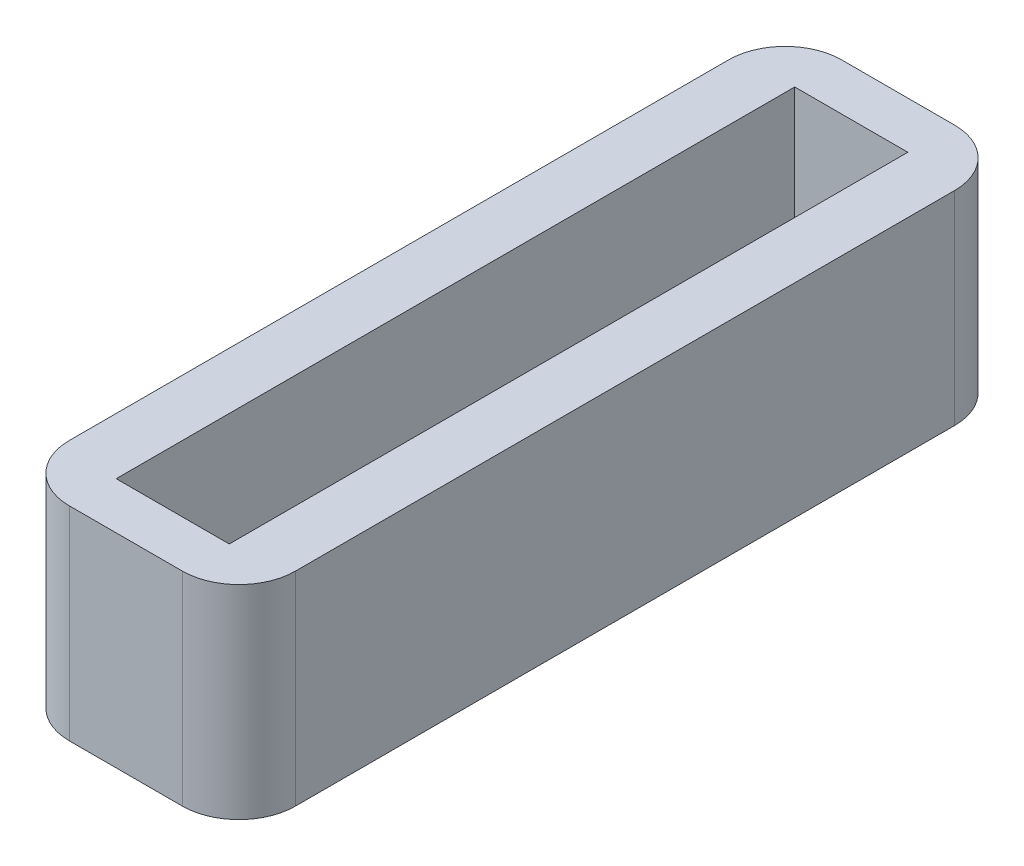
ISO-10303-21;
HEADER;
FILE_DESCRIPTION(('STEP AP214'),'2;1');
FILE_NAME('part.step','',(''),(''),'','','');
FILE_SCHEMA(('AUTOMOTIVE_DESIGN { 1 0 10303 214 1 1 1 1 }'));
ENDSEC;
DATA;
#1=APPLICATION_CONTEXT('core data for automotive mechanical design processes');
#2=APPLICATION_PROTOCOL_DEFINITION('international standard','automotive_design',2000,#1);
#3=PRODUCT_CONTEXT('',#1,'mechanical');
#4=PRODUCT('Part','Part','',(#3));
#5=PRODUCT_RELATED_PRODUCT_CATEGORY('part','',(#4));
#6=PRODUCT_DEFINITION_FORMATION('','',#4);
#7=PRODUCT_DEFINITION_CONTEXT('part definition',#1,'design');
#8=PRODUCT_DEFINITION('design','',#6,#7);
#9=PRODUCT_DEFINITION_SHAPE('','',#8);
#10=(LENGTH_UNIT() NAMED_UNIT(*) SI_UNIT(.MILLI.,.METRE.));
#11=(NAMED_UNIT(*) PLANE_ANGLE_UNIT() SI_UNIT($,.RADIAN.));
#12=(NAMED_UNIT(*) SI_UNIT($,.STERADIAN.) SOLID_ANGLE_UNIT());
#13=UNCERTAINTY_MEASURE_WITH_UNIT(LENGTH_MEASURE(1.E-05),#10,'distance_accuracy_value','');
#14=(GEOMETRIC_REPRESENTATION_CONTEXT(3) GLOBAL_UNCERTAINTY_ASSIGNED_CONTEXT((#13)) GLOBAL_UNIT_ASSIGNED_CONTEXT((#10,
#11,#12)) REPRESENTATION_CONTEXT('',''));
#15=CARTESIAN_POINT('',(0.,0.,0.));
#16=DIRECTION('',(0.,0.,1.));
#17=DIRECTION('',(1.,0.,0.));
#18=AXIS2_PLACEMENT_3D('',#15,#16,#17);
#19=CARTESIAN_POINT('',(0.,3.6,0.));
#20=DIRECTION('',(0.,1.,0.));
#21=DIRECTION('',(0.,0.,1.));
#22=AXIS2_PLACEMENT_3D('',#19,#20,#21);
#23=PLANE('',#22);
#24=DIRECTION('',(-1.,0.,0.));
#25=VECTOR('',#24,1.);
#26=CARTESIAN_POINT('',(-2.,3.6,-6.82971919942776));
#27=LINE('',#26,#25);
#28=CARTESIAN_POINT('',(0.999999999999999,3.6,-6.82971919942776));
#29=VERTEX_POINT('',#28);
#30=CARTESIAN_POINT('',(-1.,3.6,-6.82971919942776));
#31=VERTEX_POINT('',#30);
#32=EDGE_CURVE('E170',#29,#31,#27,.T.);
#33=ORIENTED_EDGE('',*,*,#32,.T.);
#34=CARTESIAN_POINT('',(-1.,3.6,-5.82971919942776));
#35=DIRECTION('',(0.,1.,0.));
#36=DIRECTION('',(0.,0.,1.));
#37=AXIS2_PLACEMENT_3D('',#34,#35,#36);
#38=CIRCLE('',#37,1.);
#39=CARTESIAN_POINT('',(-2.,3.6,-5.82971919942776));
#40=VERTEX_POINT('',#39);
#41=EDGE_CURVE('E210',#31,#40,#38,.T.);
#42=ORIENTED_EDGE('',*,*,#41,.T.);
#43=DIRECTION('',(0.,0.,1.));
#44=VECTOR('',#43,1.);
#45=CARTESIAN_POINT('',(-2.,3.6,-6.82971919942776));
#46=LINE('',#45,#44);
#47=CARTESIAN_POINT('',(-2.,3.6,5.82971919942775));
#48=VERTEX_POINT('',#47);
#49=EDGE_CURVE('E174',#40,#48,#46,.T.);
#50=ORIENTED_EDGE('',*,*,#49,.T.);
#51=CARTESIAN_POINT('',(-0.999999999999999,3.6,5.82971919942776));
#52=DIRECTION('',(0.,1.,0.));
#53=DIRECTION('',(0.,0.,1.));
#54=AXIS2_PLACEMENT_3D('',#51,#52,#53);
#55=CIRCLE('',#54,1.);
#56=CARTESIAN_POINT('',(-0.999999999999999,3.6,6.82971919942776));
#57=VERTEX_POINT('',#56);
#58=EDGE_CURVE('E56',#48,#57,#55,.T.);
#59=ORIENTED_EDGE('',*,*,#58,.T.);
#60=DIRECTION('',(1.,0.,0.));
#61=VECTOR('',#60,1.);
#62=CARTESIAN_POINT('',(-2.,3.6,6.82971919942776));
#63=LINE('',#62,#61);
#64=CARTESIAN_POINT('',(1.,3.6,6.82971919942776));
#65=VERTEX_POINT('',#64);
#66=EDGE_CURVE('E176',#57,#65,#63,.T.);
#67=ORIENTED_EDGE('',*,*,#66,.T.);
#68=CARTESIAN_POINT('',(1.,3.6,5.82971919942775));
#69=DIRECTION('',(0.,1.,0.));
#70=DIRECTION('',(0.,0.,1.));
#71=AXIS2_PLACEMENT_3D('',#68,#69,#70);
#72=CIRCLE('',#71,1.);
#73=CARTESIAN_POINT('',(2.,3.6,5.82971919942775));
#74=VERTEX_POINT('',#73);
#75=EDGE_CURVE('E205',#65,#74,#72,.T.);
#76=ORIENTED_EDGE('',*,*,#75,.T.);
#77=DIRECTION('',(0.,0.,-1.));
#78=VECTOR('',#77,1.);
#79=CARTESIAN_POINT('',(2.,3.6,-6.82971919942776));
#80=LINE('',#79,#78);
#81=CARTESIAN_POINT('',(2.,3.6,-5.82971919942776));
#82=VERTEX_POINT('',#81);
#83=EDGE_CURVE('E167',#74,#82,#80,.T.);
#84=ORIENTED_EDGE('',*,*,#83,.T.);
#85=CARTESIAN_POINT('',(0.999999999999999,3.6,-5.82971919942776));
#86=DIRECTION('',(0.,1.,0.));
#87=DIRECTION('',(0.,0.,1.));
#88=AXIS2_PLACEMENT_3D('',#85,#86,#87);
#89=CIRCLE('',#88,1.);
#90=EDGE_CURVE('E208',#82,#29,#89,.T.);
#91=ORIENTED_EDGE('',*,*,#90,.T.);
#92=EDGE_LOOP('',(#33,#42,#50,#59,#67,#76,#84,#91));
#93=FACE_BOUND('',#92,.T.);
#94=DIRECTION('',(-1.,0.,0.));
#95=VECTOR('',#94,1.);
#96=CARTESIAN_POINT('',(-1.,3.6,-6.00000000000001));
#97=LINE('',#96,#95);
#98=CARTESIAN_POINT('',(0.999999999999999,3.6,-6.00000000000001));
#99=VERTEX_POINT('',#98);
#100=CARTESIAN_POINT('',(-1.,3.6,-6.00000000000001));
#101=VERTEX_POINT('',#100);
#102=EDGE_CURVE('E136',#99,#101,#97,.T.);
#103=ORIENTED_EDGE('',*,*,#102,.F.);
#104=DIRECTION('',(0.,0.,-1.));
#105=VECTOR('',#104,1.);
#106=CARTESIAN_POINT('',(0.999999999999999,3.6,-6.00000000000001));
#107=LINE('',#106,#105);
#108=CARTESIAN_POINT('',(1.,3.6,6.));
#109=VERTEX_POINT('',#108);
#110=EDGE_CURVE('E126',#109,#99,#107,.T.);
#111=ORIENTED_EDGE('',*,*,#110,.F.);
#112=DIRECTION('',(1.,0.,0.));
#113=VECTOR('',#112,1.);
#114=CARTESIAN_POINT('',(-0.999999999999999,3.6,6.));
#115=LINE('',#114,#113);
#116=CARTESIAN_POINT('',(-0.999999999999999,3.6,6.));
#117=VERTEX_POINT('',#116);
#118=EDGE_CURVE('E151',#117,#109,#115,.T.);
#119=ORIENTED_EDGE('',*,*,#118,.F.);
#120=DIRECTION('',(0.,0.,1.));
#121=VECTOR('',#120,1.);
#122=CARTESIAN_POINT('',(-1.,3.6,-6.00000000000001));
#123=LINE('',#122,#121);
#124=EDGE_CURVE('E149',#101,#117,#123,.T.);
#125=ORIENTED_EDGE('',*,*,#124,.F.);
#126=EDGE_LOOP('',(#103,#111,#119,#125));
#127=FACE_BOUND('',#126,.T.);
#128=ADVANCED_FACE('F35',(#93,#127),#23,.T.);
#129=CARTESIAN_POINT('',(0.,0.,0.));
#130=DIRECTION('',(0.,1.,0.));
#131=DIRECTION('',(0.,0.,1.));
#132=AXIS2_PLACEMENT_3D('',#129,#130,#131);
#133=PLANE('',#132);
#134=DIRECTION('',(0.,0.,1.));
#135=VECTOR('',#134,1.);
#136=CARTESIAN_POINT('',(-2.,0.,-6.82971919942776));
#137=LINE('',#136,#135);
#138=CARTESIAN_POINT('',(-2.,0.,-5.82971919942776));
#139=VERTEX_POINT('',#138);
#140=CARTESIAN_POINT('',(-2.,0.,5.82971919942775));
#141=VERTEX_POINT('',#140);
#142=EDGE_CURVE('E184',#139,#141,#137,.T.);
#143=ORIENTED_EDGE('',*,*,#142,.F.);
#144=CARTESIAN_POINT('',(-1.,0.,-5.82971919942776));
#145=DIRECTION('',(0.,1.,0.));
#146=DIRECTION('',(0.,0.,1.));
#147=AXIS2_PLACEMENT_3D('',#144,#145,#146);
#148=CIRCLE('',#147,1.);
#149=CARTESIAN_POINT('',(-1.,0.,-6.82971919942776));
#150=VERTEX_POINT('',#149);
#151=EDGE_CURVE('E198',#139,#150,#148,.F.);
#152=ORIENTED_EDGE('',*,*,#151,.T.);
#153=DIRECTION('',(-1.,0.,0.));
#154=VECTOR('',#153,1.);
#155=CARTESIAN_POINT('',(-2.,0.,-6.82971919942776));
#156=LINE('',#155,#154);
#157=CARTESIAN_POINT('',(0.999999999999999,0.,-6.82971919942776));
#158=VERTEX_POINT('',#157);
#159=EDGE_CURVE('E181',#158,#150,#156,.T.);
#160=ORIENTED_EDGE('',*,*,#159,.F.);
#161=CARTESIAN_POINT('',(0.999999999999999,0.,-5.82971919942776));
#162=DIRECTION('',(0.,1.,0.));
#163=DIRECTION('',(0.,0.,1.));
#164=AXIS2_PLACEMENT_3D('',#161,#162,#163);
#165=CIRCLE('',#164,1.);
#166=CARTESIAN_POINT('',(2.,0.,-5.82971919942776));
#167=VERTEX_POINT('',#166);
#168=EDGE_CURVE('E196',#158,#167,#165,.F.);
#169=ORIENTED_EDGE('',*,*,#168,.T.);
#170=DIRECTION('',(0.,0.,-1.));
#171=VECTOR('',#170,1.);
#172=CARTESIAN_POINT('',(2.,0.,-6.82971919942776));
#173=LINE('',#172,#171);
#174=CARTESIAN_POINT('',(2.,0.,5.82971919942775));
#175=VERTEX_POINT('',#174);
#176=EDGE_CURVE('E144',#175,#167,#173,.T.);
#177=ORIENTED_EDGE('',*,*,#176,.F.);
#178=CARTESIAN_POINT('',(1.,0.,5.82971919942775));
#179=DIRECTION('',(0.,1.,0.));
#180=DIRECTION('',(0.,0.,1.));
#181=AXIS2_PLACEMENT_3D('',#178,#179,#180);
#182=CIRCLE('',#181,1.);
#183=CARTESIAN_POINT('',(1.,0.,6.82971919942776));
#184=VERTEX_POINT('',#183);
#185=EDGE_CURVE('E192',#175,#184,#182,.F.);
#186=ORIENTED_EDGE('',*,*,#185,.T.);
#187=DIRECTION('',(1.,0.,0.));
#188=VECTOR('',#187,1.);
#189=CARTESIAN_POINT('',(-2.,0.,6.82971919942776));
#190=LINE('',#189,#188);
#191=CARTESIAN_POINT('',(-0.999999999999999,0.,6.82971919942776));
#192=VERTEX_POINT('',#191);
#193=EDGE_CURVE('E171',#192,#184,#190,.T.);
#194=ORIENTED_EDGE('',*,*,#193,.F.);
#195=CARTESIAN_POINT('',(-0.999999999999999,0.,5.82971919942776));
#196=DIRECTION('',(0.,1.,0.));
#197=DIRECTION('',(0.,0.,1.));
#198=AXIS2_PLACEMENT_3D('',#195,#196,#197);
#199=CIRCLE('',#198,1.);
#200=EDGE_CURVE('E194',#192,#141,#199,.F.);
#201=ORIENTED_EDGE('',*,*,#200,.T.);
#202=EDGE_LOOP('',(#143,#152,#160,#169,#177,#186,#194,#201));
#203=FACE_BOUND('',#202,.T.);
#204=DIRECTION('',(0.,0.,-1.));
#205=VECTOR('',#204,1.);
#206=CARTESIAN_POINT('',(0.999999999999999,0.,-6.00000000000001));
#207=LINE('',#206,#205);
#208=CARTESIAN_POINT('',(1.,0.,6.));
#209=VERTEX_POINT('',#208);
#210=CARTESIAN_POINT('',(0.999999999999999,0.,-6.00000000000001));
#211=VERTEX_POINT('',#210);
#212=EDGE_CURVE('E155',#209,#211,#207,.T.);
#213=ORIENTED_EDGE('',*,*,#212,.T.);
#214=DIRECTION('',(-1.,0.,0.));
#215=VECTOR('',#214,1.);
#216=CARTESIAN_POINT('',(-1.,0.,-6.00000000000001));
#217=LINE('',#216,#215);
#218=CARTESIAN_POINT('',(-1.,0.,-6.00000000000001));
#219=VERTEX_POINT('',#218);
#220=EDGE_CURVE('E143',#211,#219,#217,.T.);
#221=ORIENTED_EDGE('',*,*,#220,.T.);
#222=DIRECTION('',(0.,0.,1.));
#223=VECTOR('',#222,1.);
#224=CARTESIAN_POINT('',(-1.,0.,-6.00000000000001));
#225=LINE('',#224,#223);
#226=CARTESIAN_POINT('',(-0.999999999999999,0.,6.));
#227=VERTEX_POINT('',#226);
#228=EDGE_CURVE('E158',#219,#227,#225,.T.);
#229=ORIENTED_EDGE('',*,*,#228,.T.);
#230=DIRECTION('',(1.,0.,0.));
#231=VECTOR('',#230,1.);
#232=CARTESIAN_POINT('',(-0.999999999999999,0.,6.));
#233=LINE('',#232,#231);
#234=EDGE_CURVE('E137',#227,#209,#233,.T.);
#235=ORIENTED_EDGE('',*,*,#234,.T.);
#236=EDGE_LOOP('',(#213,#221,#229,#235));
#237=FACE_BOUND('',#236,.T.);
#238=ADVANCED_FACE('F234',(#203,#237),#133,.F.);
#239=CARTESIAN_POINT('',(2.,3.6,-6.82971919942776));
#240=DIRECTION('',(-1.,0.,0.));
#241=DIRECTION('',(0.,0.,1.));
#242=AXIS2_PLACEMENT_3D('',#239,#240,#241);
#243=PLANE('',#242);
#244=ORIENTED_EDGE('',*,*,#176,.T.);
#245=DIRECTION('',(0.,-1.,0.));
#246=VECTOR('',#245,1.);
#247=CARTESIAN_POINT('',(2.,3.6,-5.82971919942776));
#248=LINE('',#247,#246);
#249=EDGE_CURVE('E215',#167,#82,#248,.F.);
#250=ORIENTED_EDGE('',*,*,#249,.T.);
#251=ORIENTED_EDGE('',*,*,#83,.F.);
#252=DIRECTION('',(0.,-1.,0.));
#253=VECTOR('',#252,1.);
#254=CARTESIAN_POINT('',(2.,3.6,5.82971919942775));
#255=LINE('',#254,#253);
#256=EDGE_CURVE('E212',#74,#175,#255,.T.);
#257=ORIENTED_EDGE('',*,*,#256,.T.);
#258=EDGE_LOOP('',(#244,#250,#251,#257));
#259=FACE_BOUND('',#258,.T.);
#260=ADVANCED_FACE('F219',(#259),#243,.F.);
#261=CARTESIAN_POINT('',(-2.,3.6,-6.82971919942776));
#262=DIRECTION('',(0.,0.,1.));
#263=DIRECTION('',(1.,0.,0.));
#264=AXIS2_PLACEMENT_3D('',#261,#262,#263);
#265=PLANE('',#264);
#266=ORIENTED_EDGE('',*,*,#159,.T.);
#267=DIRECTION('',(0.,-1.,0.));
#268=VECTOR('',#267,1.);
#269=CARTESIAN_POINT('',(-1.,3.6,-6.82971919942776));
#270=LINE('',#269,#268);
#271=EDGE_CURVE('E203',#150,#31,#270,.F.);
#272=ORIENTED_EDGE('',*,*,#271,.T.);
#273=ORIENTED_EDGE('',*,*,#32,.F.);
#274=DIRECTION('',(0.,-1.,0.));
#275=VECTOR('',#274,1.);
#276=CARTESIAN_POINT('',(0.999999999999999,3.6,-6.82971919942776));
#277=LINE('',#276,#275);
#278=EDGE_CURVE('E200',#29,#158,#277,.T.);
#279=ORIENTED_EDGE('',*,*,#278,.T.);
#280=EDGE_LOOP('',(#266,#272,#273,#279));
#281=FACE_BOUND('',#280,.T.);
#282=ADVANCED_FACE('F230',(#281),#265,.F.);
#283=CARTESIAN_POINT('',(-2.,3.6,-6.82971919942776));
#284=DIRECTION('',(1.,0.,0.));
#285=DIRECTION('',(0.,0.,-1.));
#286=AXIS2_PLACEMENT_3D('',#283,#284,#285);
#287=PLANE('',#286);
#288=ORIENTED_EDGE('',*,*,#49,.F.);
#289=DIRECTION('',(0.,-1.,0.));
#290=VECTOR('',#289,1.);
#291=CARTESIAN_POINT('',(-2.,3.6,-5.82971919942776));
#292=LINE('',#291,#290);
#293=EDGE_CURVE('E189',#40,#139,#292,.T.);
#294=ORIENTED_EDGE('',*,*,#293,.T.);
#295=ORIENTED_EDGE('',*,*,#142,.T.);
#296=DIRECTION('',(0.,-1.,0.));
#297=VECTOR('',#296,1.);
#298=CARTESIAN_POINT('',(-2.,3.6,5.82971919942775));
#299=LINE('',#298,#297);
#300=EDGE_CURVE('E178',#141,#48,#299,.F.);
#301=ORIENTED_EDGE('',*,*,#300,.T.);
#302=EDGE_LOOP('',(#288,#294,#295,#301));
#303=FACE_BOUND('',#302,.T.);
#304=ADVANCED_FACE('F242',(#303),#287,.F.);
#305=CARTESIAN_POINT('',(-2.,3.6,6.82971919942776));
#306=DIRECTION('',(0.,0.,-1.));
#307=DIRECTION('',(-1.,0.,0.));
#308=AXIS2_PLACEMENT_3D('',#305,#306,#307);
#309=PLANE('',#308);
#310=ORIENTED_EDGE('',*,*,#66,.F.);
#311=DIRECTION('',(0.,-1.,0.));
#312=VECTOR('',#311,1.);
#313=CARTESIAN_POINT('',(-0.999999999999999,3.6,6.82971919942776));
#314=LINE('',#313,#312);
#315=EDGE_CURVE('E11',#57,#192,#314,.T.);
#316=ORIENTED_EDGE('',*,*,#315,.T.);
#317=ORIENTED_EDGE('',*,*,#193,.T.);
#318=DIRECTION('',(0.,-1.,0.));
#319=VECTOR('',#318,1.);
#320=CARTESIAN_POINT('',(1.,3.6,6.82971919942776));
#321=LINE('',#320,#319);
#322=EDGE_CURVE('E43',#184,#65,#321,.F.);
#323=ORIENTED_EDGE('',*,*,#322,.T.);
#324=EDGE_LOOP('',(#310,#316,#317,#323));
#325=FACE_BOUND('',#324,.T.);
#326=ADVANCED_FACE('F248',(#325),#309,.F.);
#327=CARTESIAN_POINT('',(0.999999999999999,3.6,-6.00000000000001));
#328=DIRECTION('',(-1.,0.,0.));
#329=DIRECTION('',(0.,0.,1.));
#330=AXIS2_PLACEMENT_3D('',#327,#328,#329);
#331=PLANE('',#330);
#332=ORIENTED_EDGE('',*,*,#212,.F.);
#333=DIRECTION('',(0.,-1.,0.));
#334=VECTOR('',#333,1.);
#335=CARTESIAN_POINT('',(1.,3.6,6.));
#336=LINE('',#335,#334);
#337=EDGE_CURVE('E132',#109,#209,#336,.T.);
#338=ORIENTED_EDGE('',*,*,#337,.F.);
#339=ORIENTED_EDGE('',*,*,#110,.T.);
#340=DIRECTION('',(0.,-1.,0.));
#341=VECTOR('',#340,1.);
#342=CARTESIAN_POINT('',(0.999999999999999,3.6,-6.00000000000001));
#343=LINE('',#342,#341);
#344=EDGE_CURVE('E129',#99,#211,#343,.T.);
#345=ORIENTED_EDGE('',*,*,#344,.T.);
#346=EDGE_LOOP('',(#332,#338,#339,#345));
#347=FACE_BOUND('',#346,.T.);
#348=ADVANCED_FACE('F128',(#347),#331,.T.);
#349=CARTESIAN_POINT('',(-1.,3.6,-6.00000000000001));
#350=DIRECTION('',(0.,0.,1.));
#351=DIRECTION('',(1.,0.,0.));
#352=AXIS2_PLACEMENT_3D('',#349,#350,#351);
#353=PLANE('',#352);
#354=ORIENTED_EDGE('',*,*,#220,.F.);
#355=ORIENTED_EDGE('',*,*,#344,.F.);
#356=ORIENTED_EDGE('',*,*,#102,.T.);
#357=DIRECTION('',(0.,-1.,0.));
#358=VECTOR('',#357,1.);
#359=CARTESIAN_POINT('',(-1.,3.6,-6.00000000000001));
#360=LINE('',#359,#358);
#361=EDGE_CURVE('E145',#101,#219,#360,.T.);
#362=ORIENTED_EDGE('',*,*,#361,.T.);
#363=EDGE_LOOP('',(#354,#355,#356,#362));
#364=FACE_BOUND('',#363,.T.);
#365=ADVANCED_FACE('F140',(#364),#353,.T.);
#366=CARTESIAN_POINT('',(-1.,3.6,-6.00000000000001));
#367=DIRECTION('',(1.,0.,0.));
#368=DIRECTION('',(0.,0.,-1.));
#369=AXIS2_PLACEMENT_3D('',#366,#367,#368);
#370=PLANE('',#369);
#371=ORIENTED_EDGE('',*,*,#228,.F.);
#372=ORIENTED_EDGE('',*,*,#361,.F.);
#373=ORIENTED_EDGE('',*,*,#124,.T.);
#374=DIRECTION('',(0.,-1.,0.));
#375=VECTOR('',#374,1.);
#376=CARTESIAN_POINT('',(-0.999999999999999,3.6,6.));
#377=LINE('',#376,#375);
#378=EDGE_CURVE('E164',#117,#227,#377,.T.);
#379=ORIENTED_EDGE('',*,*,#378,.T.);
#380=EDGE_LOOP('',(#371,#372,#373,#379));
#381=FACE_BOUND('',#380,.T.);
#382=ADVANCED_FACE('F304',(#381),#370,.T.);
#383=CARTESIAN_POINT('',(-0.999999999999999,3.6,6.));
#384=DIRECTION('',(0.,0.,-1.));
#385=DIRECTION('',(-1.,0.,0.));
#386=AXIS2_PLACEMENT_3D('',#383,#384,#385);
#387=PLANE('',#386);
#388=ORIENTED_EDGE('',*,*,#234,.F.);
#389=ORIENTED_EDGE('',*,*,#378,.F.);
#390=ORIENTED_EDGE('',*,*,#118,.T.);
#391=ORIENTED_EDGE('',*,*,#337,.T.);
#392=EDGE_LOOP('',(#388,#389,#390,#391));
#393=FACE_BOUND('',#392,.T.);
#394=ADVANCED_FACE('F273',(#393),#387,.T.);
#395=CARTESIAN_POINT('',(-1.,3.6,-5.82971919942776));
#396=DIRECTION('',(0.,-1.,0.));
#397=DIRECTION('',(0.,0.,-1.));
#398=AXIS2_PLACEMENT_3D('',#395,#396,#397);
#399=CYLINDRICAL_SURFACE('',#398,1.);
#400=ORIENTED_EDGE('',*,*,#41,.F.);
#401=ORIENTED_EDGE('',*,*,#271,.F.);
#402=ORIENTED_EDGE('',*,*,#151,.F.);
#403=ORIENTED_EDGE('',*,*,#293,.F.);
#404=EDGE_LOOP('',(#400,#401,#402,#403));
#405=FACE_BOUND('',#404,.T.);
#406=ADVANCED_FACE('F239',(#405),#399,.T.);
#407=CARTESIAN_POINT('',(0.999999999999999,3.6,-5.82971919942776));
#408=DIRECTION('',(0.,-1.,0.));
#409=DIRECTION('',(0.,0.,-1.));
#410=AXIS2_PLACEMENT_3D('',#407,#408,#409);
#411=CYLINDRICAL_SURFACE('',#410,1.);
#412=ORIENTED_EDGE('',*,*,#90,.F.);
#413=ORIENTED_EDGE('',*,*,#249,.F.);
#414=ORIENTED_EDGE('',*,*,#168,.F.);
#415=ORIENTED_EDGE('',*,*,#278,.F.);
#416=EDGE_LOOP('',(#412,#413,#414,#415));
#417=FACE_BOUND('',#416,.T.);
#418=ADVANCED_FACE('F227',(#417),#411,.T.);
#419=CARTESIAN_POINT('',(-0.999999999999999,3.6,5.82971919942776));
#420=DIRECTION('',(0.,-1.,0.));
#421=DIRECTION('',(0.,0.,-1.));
#422=AXIS2_PLACEMENT_3D('',#419,#420,#421);
#423=CYLINDRICAL_SURFACE('',#422,1.);
#424=ORIENTED_EDGE('',*,*,#58,.F.);
#425=ORIENTED_EDGE('',*,*,#300,.F.);
#426=ORIENTED_EDGE('',*,*,#200,.F.);
#427=ORIENTED_EDGE('',*,*,#315,.F.);
#428=EDGE_LOOP('',(#424,#425,#426,#427));
#429=FACE_BOUND('',#428,.T.);
#430=ADVANCED_FACE('F246',(#429),#423,.T.);
#431=CARTESIAN_POINT('',(1.,3.6,5.82971919942775));
#432=DIRECTION('',(0.,-1.,0.));
#433=DIRECTION('',(0.,0.,-1.));
#434=AXIS2_PLACEMENT_3D('',#431,#432,#433);
#435=CYLINDRICAL_SURFACE('',#434,1.);
#436=ORIENTED_EDGE('',*,*,#75,.F.);
#437=ORIENTED_EDGE('',*,*,#322,.F.);
#438=ORIENTED_EDGE('',*,*,#185,.F.);
#439=ORIENTED_EDGE('',*,*,#256,.F.);
#440=EDGE_LOOP('',(#436,#437,#438,#439));
#441=FACE_BOUND('',#440,.T.);
#442=ADVANCED_FACE('F37',(#441),#435,.T.);
#443=CLOSED_SHELL('',(#128,#238,#260,#282,#304,#326,#348,#365,#382,#394,#406,#418,#430,#442));
#444=MANIFOLD_SOLID_BREP('B2',#443);
#445=ADVANCED_BREP_SHAPE_REPRESENTATION('',(#18,#444),#14);
#446=SHAPE_DEFINITION_REPRESENTATION(#9,#445);
ENDSEC;
END-ISO-10303-21;
